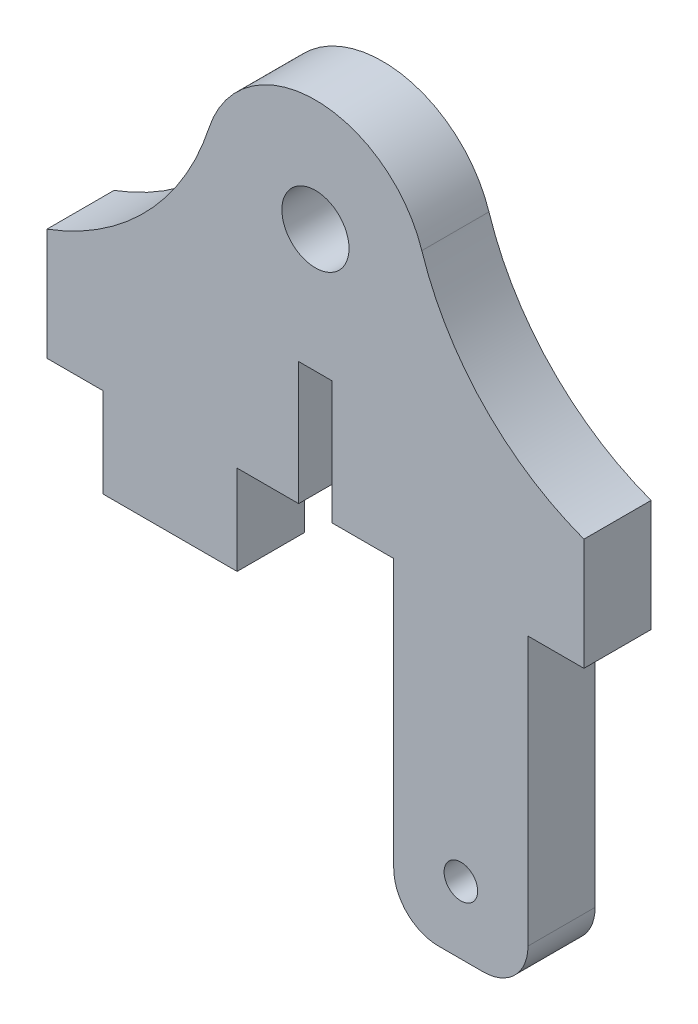
ISO-10303-21;
HEADER;
FILE_DESCRIPTION(('STEP AP214'),'2;1');
FILE_NAME('part.step','',(''),(''),'','','');
FILE_SCHEMA(('AUTOMOTIVE_DESIGN { 1 0 10303 214 1 1 1 1 }'));
ENDSEC;
DATA;
#1=APPLICATION_CONTEXT('core data for automotive mechanical design processes');
#2=APPLICATION_PROTOCOL_DEFINITION('international standard','automotive_design',2000,#1);
#3=PRODUCT_CONTEXT('',#1,'mechanical');
#4=PRODUCT('Part','Part','',(#3));
#5=PRODUCT_RELATED_PRODUCT_CATEGORY('part','',(#4));
#6=PRODUCT_DEFINITION_FORMATION('','',#4);
#7=PRODUCT_DEFINITION_CONTEXT('part definition',#1,'design');
#8=PRODUCT_DEFINITION('design','',#6,#7);
#9=PRODUCT_DEFINITION_SHAPE('','',#8);
#10=(LENGTH_UNIT() NAMED_UNIT(*) SI_UNIT(.MILLI.,.METRE.));
#11=(NAMED_UNIT(*) PLANE_ANGLE_UNIT() SI_UNIT($,.RADIAN.));
#12=(NAMED_UNIT(*) SI_UNIT($,.STERADIAN.) SOLID_ANGLE_UNIT());
#13=UNCERTAINTY_MEASURE_WITH_UNIT(LENGTH_MEASURE(1.E-05),#10,'distance_accuracy_value','');
#14=(GEOMETRIC_REPRESENTATION_CONTEXT(3) GLOBAL_UNCERTAINTY_ASSIGNED_CONTEXT((#13)) GLOBAL_UNIT_ASSIGNED_CONTEXT((#10,
#11,#12)) REPRESENTATION_CONTEXT('',''));
#15=CARTESIAN_POINT('',(0.,0.,0.));
#16=DIRECTION('',(0.,0.,1.));
#17=DIRECTION('',(1.,0.,0.));
#18=AXIS2_PLACEMENT_3D('',#15,#16,#17);
#19=CARTESIAN_POINT('',(16.1680987660606,5.25286419878796,3.));
#20=DIRECTION('',(0.,0.,-1.));
#21=DIRECTION('',(-1.,0.,0.));
#22=AXIS2_PLACEMENT_3D('',#19,#20,#21);
#23=PLANE('',#22);
#24=DIRECTION('',(0.,-1.,0.));
#25=VECTOR('',#24,1.);
#26=CARTESIAN_POINT('',(3.5,-11.,3.));
#27=LINE('',#26,#25);
#28=CARTESIAN_POINT('',(3.5,-11.,3.));
#29=VERTEX_POINT('',#28);
#30=CARTESIAN_POINT('',(3.5,-23.,3.));
#31=VERTEX_POINT('',#30);
#32=EDGE_CURVE('E215',#29,#31,#27,.T.);
#33=ORIENTED_EDGE('',*,*,#32,.T.);
#34=CARTESIAN_POINT('',(5.5,-23.,3.));
#35=DIRECTION('',(0.,0.,-1.));
#36=DIRECTION('',(-1.,0.,0.));
#37=AXIS2_PLACEMENT_3D('',#34,#35,#36);
#38=CIRCLE('',#37,2.);
#39=CARTESIAN_POINT('',(5.5,-25.,3.));
#40=VERTEX_POINT('',#39);
#41=EDGE_CURVE('E52',#31,#40,#38,.F.);
#42=ORIENTED_EDGE('',*,*,#41,.T.);
#43=DIRECTION('',(1.,0.,0.));
#44=VECTOR('',#43,1.);
#45=CARTESIAN_POINT('',(3.5,-25.,3.));
#46=LINE('',#45,#44);
#47=CARTESIAN_POINT('',(7.5,-25.,3.));
#48=VERTEX_POINT('',#47);
#49=EDGE_CURVE('E209',#40,#48,#46,.T.);
#50=ORIENTED_EDGE('',*,*,#49,.T.);
#51=CARTESIAN_POINT('',(7.5,-23.,3.));
#52=DIRECTION('',(0.,0.,-1.));
#53=DIRECTION('',(-1.,0.,0.));
#54=AXIS2_PLACEMENT_3D('',#51,#52,#53);
#55=CIRCLE('',#54,2.);
#56=CARTESIAN_POINT('',(9.5,-23.,3.));
#57=VERTEX_POINT('',#56);
#58=EDGE_CURVE('E59',#48,#57,#55,.F.);
#59=ORIENTED_EDGE('',*,*,#58,.T.);
#60=DIRECTION('',(0.,-1.,0.));
#61=VECTOR('',#60,1.);
#62=CARTESIAN_POINT('',(9.5,-25.,3.));
#63=LINE('',#62,#61);
#64=CARTESIAN_POINT('',(9.5,-11.,3.));
#65=VERTEX_POINT('',#64);
#66=EDGE_CURVE('E200',#65,#57,#63,.T.);
#67=ORIENTED_EDGE('',*,*,#66,.F.);
#68=DIRECTION('',(-1.,0.,0.));
#69=VECTOR('',#68,1.);
#70=CARTESIAN_POINT('',(12.,-11.,3.));
#71=LINE('',#70,#69);
#72=CARTESIAN_POINT('',(12.,-11.,3.));
#73=VERTEX_POINT('',#72);
#74=EDGE_CURVE('E187',#73,#65,#71,.T.);
#75=ORIENTED_EDGE('',*,*,#74,.F.);
#76=DIRECTION('',(0.,1.,0.));
#77=VECTOR('',#76,1.);
#78=CARTESIAN_POINT('',(12.,-25.,3.));
#79=LINE('',#78,#77);
#80=CARTESIAN_POINT('',(12.,-6.,3.));
#81=VERTEX_POINT('',#80);
#82=EDGE_CURVE('E198',#73,#81,#79,.T.);
#83=ORIENTED_EDGE('',*,*,#82,.T.);
#84=CARTESIAN_POINT('',(16.1680987660606,5.25286419878796,3.));
#85=DIRECTION('',(0.,0.,-1.));
#86=DIRECTION('',(-1.,0.,0.));
#87=AXIS2_PLACEMENT_3D('',#84,#85,#86);
#88=CIRCLE('',#87,12.);
#89=CARTESIAN_POINT('',(4.75532316648843,1.54496005846705,3.));
#90=VERTEX_POINT('',#89);
#91=EDGE_CURVE('E208',#81,#90,#88,.T.);
#92=ORIENTED_EDGE('',*,*,#91,.T.);
#93=CARTESIAN_POINT('',(0.,0.,3.));
#94=DIRECTION('',(0.,0.,1.));
#95=DIRECTION('',(1.,0.,0.));
#96=AXIS2_PLACEMENT_3D('',#93,#94,#95);
#97=CIRCLE('',#96,5.);
#98=CARTESIAN_POINT('',(-4.75532316648842,1.54496005846705,3.));
#99=VERTEX_POINT('',#98);
#100=EDGE_CURVE('E213',#90,#99,#97,.T.);
#101=ORIENTED_EDGE('',*,*,#100,.T.);
#102=CARTESIAN_POINT('',(-16.1680987660606,5.25286419878795,3.));
#103=DIRECTION('',(0.,0.,-1.));
#104=DIRECTION('',(1.,0.,0.));
#105=AXIS2_PLACEMENT_3D('',#102,#103,#104);
#106=CIRCLE('',#105,12.);
#107=CARTESIAN_POINT('',(-12.,-6.,3.));
#108=VERTEX_POINT('',#107);
#109=EDGE_CURVE('E221',#99,#108,#106,.T.);
#110=ORIENTED_EDGE('',*,*,#109,.T.);
#111=DIRECTION('',(0.,-1.,0.));
#112=VECTOR('',#111,1.);
#113=CARTESIAN_POINT('',(-12.,-11.,3.));
#114=LINE('',#113,#112);
#115=CARTESIAN_POINT('',(-12.,-11.,3.));
#116=VERTEX_POINT('',#115);
#117=EDGE_CURVE('E268',#108,#116,#114,.T.);
#118=ORIENTED_EDGE('',*,*,#117,.T.);
#119=DIRECTION('',(-1.,0.,0.));
#120=VECTOR('',#119,1.);
#121=CARTESIAN_POINT('',(-12.,-11.,3.));
#122=LINE('',#121,#120);
#123=CARTESIAN_POINT('',(-9.5,-11.,3.));
#124=VERTEX_POINT('',#123);
#125=EDGE_CURVE('E381',#124,#116,#122,.T.);
#126=ORIENTED_EDGE('',*,*,#125,.F.);
#127=DIRECTION('',(0.,1.,0.));
#128=VECTOR('',#127,1.);
#129=CARTESIAN_POINT('',(-9.5,-15.,3.));
#130=LINE('',#129,#128);
#131=CARTESIAN_POINT('',(-9.5,-15.,3.));
#132=VERTEX_POINT('',#131);
#133=EDGE_CURVE('E376',#132,#124,#130,.T.);
#134=ORIENTED_EDGE('',*,*,#133,.F.);
#135=DIRECTION('',(1.,0.,0.));
#136=VECTOR('',#135,1.);
#137=CARTESIAN_POINT('',(-12.,-15.,3.));
#138=LINE('',#137,#136);
#139=CARTESIAN_POINT('',(-3.5,-15.,3.));
#140=VERTEX_POINT('',#139);
#141=EDGE_CURVE('E423',#132,#140,#138,.T.);
#142=ORIENTED_EDGE('',*,*,#141,.T.);
#143=DIRECTION('',(0.,1.,0.));
#144=VECTOR('',#143,1.);
#145=CARTESIAN_POINT('',(-3.5,-15.,3.));
#146=LINE('',#145,#144);
#147=CARTESIAN_POINT('',(-3.5,-11.,3.));
#148=VERTEX_POINT('',#147);
#149=EDGE_CURVE('E389',#140,#148,#146,.T.);
#150=ORIENTED_EDGE('',*,*,#149,.T.);
#151=DIRECTION('',(1.,0.,0.));
#152=VECTOR('',#151,1.);
#153=CARTESIAN_POINT('',(-0.749999999999999,-11.,3.));
#154=LINE('',#153,#152);
#155=CARTESIAN_POINT('',(-0.749999999999999,-11.,3.));
#156=VERTEX_POINT('',#155);
#157=EDGE_CURVE('E371',#148,#156,#154,.T.);
#158=ORIENTED_EDGE('',*,*,#157,.T.);
#159=DIRECTION('',(0.,1.,0.));
#160=VECTOR('',#159,1.);
#161=CARTESIAN_POINT('',(-0.749999999999999,-11.,3.));
#162=LINE('',#161,#160);
#163=CARTESIAN_POINT('',(-0.749999999999999,-5.5,3.));
#164=VERTEX_POINT('',#163);
#165=EDGE_CURVE('E359',#156,#164,#162,.T.);
#166=ORIENTED_EDGE('',*,*,#165,.T.);
#167=DIRECTION('',(1.,0.,0.));
#168=VECTOR('',#167,1.);
#169=CARTESIAN_POINT('',(-0.749999999999999,-5.5,3.));
#170=LINE('',#169,#168);
#171=CARTESIAN_POINT('',(0.750000000000001,-5.5,3.));
#172=VERTEX_POINT('',#171);
#173=EDGE_CURVE('E354',#164,#172,#170,.T.);
#174=ORIENTED_EDGE('',*,*,#173,.T.);
#175=DIRECTION('',(0.,-1.,0.));
#176=VECTOR('',#175,1.);
#177=CARTESIAN_POINT('',(0.750000000000001,-5.5,3.));
#178=LINE('',#177,#176);
#179=CARTESIAN_POINT('',(0.750000000000002,-11.,3.));
#180=VERTEX_POINT('',#179);
#181=EDGE_CURVE('E350',#172,#180,#178,.T.);
#182=ORIENTED_EDGE('',*,*,#181,.T.);
#183=DIRECTION('',(1.,0.,0.));
#184=VECTOR('',#183,1.);
#185=CARTESIAN_POINT('',(0.750000000000002,-11.,3.));
#186=LINE('',#185,#184);
#187=EDGE_CURVE('E341',#180,#29,#186,.T.);
#188=ORIENTED_EDGE('',*,*,#187,.T.);
#189=EDGE_LOOP('',(#33,#42,#50,#59,#67,#75,#83,#92,#101,#110,#118,#126,#134,#142,#150,#158,#166,
#174,#182,#188));
#190=FACE_BOUND('',#189,.T.);
#191=CARTESIAN_POINT('',(0.,0.,3.));
#192=DIRECTION('',(0.,0.,1.));
#193=DIRECTION('',(1.,0.,0.));
#194=AXIS2_PLACEMENT_3D('',#191,#192,#193);
#195=CIRCLE('',#194,1.5);
#196=CARTESIAN_POINT('',(1.5,0.,3.));
#197=VERTEX_POINT('',#196);
#198=EDGE_CURVE('E230',#197,#197,#195,.T.);
#199=ORIENTED_EDGE('',*,*,#198,.F.);
#200=EDGE_LOOP('',(#199));
#201=FACE_BOUND('',#200,.T.);
#202=CARTESIAN_POINT('',(6.5,-22.,3.));
#203=DIRECTION('',(0.,0.,1.));
#204=DIRECTION('',(1.,0.,0.));
#205=AXIS2_PLACEMENT_3D('',#202,#203,#204);
#206=CIRCLE('',#205,0.75);
#207=CARTESIAN_POINT('',(7.25,-22.,3.));
#208=VERTEX_POINT('',#207);
#209=EDGE_CURVE('E406',#208,#208,#206,.T.);
#210=ORIENTED_EDGE('',*,*,#209,.F.);
#211=EDGE_LOOP('',(#210));
#212=FACE_BOUND('',#211,.T.);
#213=ADVANCED_FACE('F43',(#190,#201,#212),#23,.F.);
#214=CARTESIAN_POINT('',(16.1680987660606,5.25286419878796,0.));
#215=DIRECTION('',(0.,0.,-1.));
#216=DIRECTION('',(-1.,0.,0.));
#217=AXIS2_PLACEMENT_3D('',#214,#215,#216);
#218=PLANE('',#217);
#219=DIRECTION('',(1.,0.,0.));
#220=VECTOR('',#219,1.);
#221=CARTESIAN_POINT('',(3.5,-25.,0.));
#222=LINE('',#221,#220);
#223=CARTESIAN_POINT('',(5.5,-25.,0.));
#224=VERTEX_POINT('',#223);
#225=CARTESIAN_POINT('',(7.5,-25.,0.));
#226=VERTEX_POINT('',#225);
#227=EDGE_CURVE('E248',#224,#226,#222,.T.);
#228=ORIENTED_EDGE('',*,*,#227,.F.);
#229=CARTESIAN_POINT('',(5.5,-23.,0.));
#230=DIRECTION('',(0.,0.,-1.));
#231=DIRECTION('',(-1.,0.,0.));
#232=AXIS2_PLACEMENT_3D('',#229,#230,#231);
#233=CIRCLE('',#232,2.);
#234=CARTESIAN_POINT('',(3.5,-23.,0.));
#235=VERTEX_POINT('',#234);
#236=EDGE_CURVE('E315',#224,#235,#233,.T.);
#237=ORIENTED_EDGE('',*,*,#236,.T.);
#238=DIRECTION('',(0.,-1.,0.));
#239=VECTOR('',#238,1.);
#240=CARTESIAN_POINT('',(3.5,-11.,0.));
#241=LINE('',#240,#239);
#242=CARTESIAN_POINT('',(3.5,-11.,0.));
#243=VERTEX_POINT('',#242);
#244=EDGE_CURVE('E245',#243,#235,#241,.T.);
#245=ORIENTED_EDGE('',*,*,#244,.F.);
#246=DIRECTION('',(1.,0.,0.));
#247=VECTOR('',#246,1.);
#248=CARTESIAN_POINT('',(0.750000000000002,-11.,0.));
#249=LINE('',#248,#247);
#250=CARTESIAN_POINT('',(0.750000000000002,-11.,0.));
#251=VERTEX_POINT('',#250);
#252=EDGE_CURVE('E242',#251,#243,#249,.T.);
#253=ORIENTED_EDGE('',*,*,#252,.F.);
#254=DIRECTION('',(0.,-1.,0.));
#255=VECTOR('',#254,1.);
#256=CARTESIAN_POINT('',(0.750000000000001,-5.5,0.));
#257=LINE('',#256,#255);
#258=CARTESIAN_POINT('',(0.750000000000001,-5.5,0.));
#259=VERTEX_POINT('',#258);
#260=EDGE_CURVE('E239',#259,#251,#257,.T.);
#261=ORIENTED_EDGE('',*,*,#260,.F.);
#262=DIRECTION('',(1.,0.,0.));
#263=VECTOR('',#262,1.);
#264=CARTESIAN_POINT('',(-0.749999999999999,-5.5,0.));
#265=LINE('',#264,#263);
#266=CARTESIAN_POINT('',(-0.749999999999999,-5.5,0.));
#267=VERTEX_POINT('',#266);
#268=EDGE_CURVE('E236',#267,#259,#265,.T.);
#269=ORIENTED_EDGE('',*,*,#268,.F.);
#270=DIRECTION('',(0.,1.,0.));
#271=VECTOR('',#270,1.);
#272=CARTESIAN_POINT('',(-0.749999999999999,-11.,0.));
#273=LINE('',#272,#271);
#274=CARTESIAN_POINT('',(-0.749999999999999,-11.,0.));
#275=VERTEX_POINT('',#274);
#276=EDGE_CURVE('E233',#275,#267,#273,.T.);
#277=ORIENTED_EDGE('',*,*,#276,.F.);
#278=DIRECTION('',(1.,0.,0.));
#279=VECTOR('',#278,1.);
#280=CARTESIAN_POINT('',(-0.749999999999999,-11.,0.));
#281=LINE('',#280,#279);
#282=CARTESIAN_POINT('',(-3.5,-11.,0.));
#283=VERTEX_POINT('',#282);
#284=EDGE_CURVE('E229',#283,#275,#281,.T.);
#285=ORIENTED_EDGE('',*,*,#284,.F.);
#286=DIRECTION('',(0.,1.,0.));
#287=VECTOR('',#286,1.);
#288=CARTESIAN_POINT('',(-3.5,-15.,0.));
#289=LINE('',#288,#287);
#290=CARTESIAN_POINT('',(-3.5,-15.,0.));
#291=VERTEX_POINT('',#290);
#292=EDGE_CURVE('E364',#291,#283,#289,.T.);
#293=ORIENTED_EDGE('',*,*,#292,.F.);
#294=DIRECTION('',(1.,0.,0.));
#295=VECTOR('',#294,1.);
#296=CARTESIAN_POINT('',(-12.,-15.,0.));
#297=LINE('',#296,#295);
#298=CARTESIAN_POINT('',(-9.5,-15.,0.));
#299=VERTEX_POINT('',#298);
#300=EDGE_CURVE('E226',#299,#291,#297,.T.);
#301=ORIENTED_EDGE('',*,*,#300,.F.);
#302=DIRECTION('',(0.,-1.,0.));
#303=VECTOR('',#302,1.);
#304=CARTESIAN_POINT('',(-9.5,5.25286419878796,0.));
#305=LINE('',#304,#303);
#306=CARTESIAN_POINT('',(-9.5,-11.,0.));
#307=VERTEX_POINT('',#306);
#308=EDGE_CURVE('E402',#307,#299,#305,.T.);
#309=ORIENTED_EDGE('',*,*,#308,.F.);
#310=DIRECTION('',(1.,0.,0.));
#311=VECTOR('',#310,1.);
#312=CARTESIAN_POINT('',(16.1680987660606,-11.,0.));
#313=LINE('',#312,#311);
#314=CARTESIAN_POINT('',(-12.,-11.,0.));
#315=VERTEX_POINT('',#314);
#316=EDGE_CURVE('E397',#315,#307,#313,.T.);
#317=ORIENTED_EDGE('',*,*,#316,.F.);
#318=DIRECTION('',(0.,-1.,0.));
#319=VECTOR('',#318,1.);
#320=CARTESIAN_POINT('',(-12.,-11.,0.));
#321=LINE('',#320,#319);
#322=CARTESIAN_POINT('',(-12.,-6.,0.));
#323=VERTEX_POINT('',#322);
#324=EDGE_CURVE('E264',#323,#315,#321,.T.);
#325=ORIENTED_EDGE('',*,*,#324,.F.);
#326=CARTESIAN_POINT('',(-16.1680987660606,5.25286419878795,0.));
#327=DIRECTION('',(0.,0.,-1.));
#328=DIRECTION('',(1.,0.,0.));
#329=AXIS2_PLACEMENT_3D('',#326,#327,#328);
#330=CIRCLE('',#329,12.);
#331=CARTESIAN_POINT('',(-4.75532316648842,1.54496005846705,0.));
#332=VERTEX_POINT('',#331);
#333=EDGE_CURVE('E261',#332,#323,#330,.T.);
#334=ORIENTED_EDGE('',*,*,#333,.F.);
#335=CARTESIAN_POINT('',(0.,0.,0.));
#336=DIRECTION('',(0.,0.,1.));
#337=DIRECTION('',(1.,0.,0.));
#338=AXIS2_PLACEMENT_3D('',#335,#336,#337);
#339=CIRCLE('',#338,5.);
#340=CARTESIAN_POINT('',(4.75532316648843,1.54496005846705,0.));
#341=VERTEX_POINT('',#340);
#342=EDGE_CURVE('E258',#341,#332,#339,.T.);
#343=ORIENTED_EDGE('',*,*,#342,.F.);
#344=CARTESIAN_POINT('',(16.1680987660606,5.25286419878796,0.));
#345=DIRECTION('',(0.,0.,-1.));
#346=DIRECTION('',(-1.,0.,0.));
#347=AXIS2_PLACEMENT_3D('',#344,#345,#346);
#348=CIRCLE('',#347,12.);
#349=CARTESIAN_POINT('',(12.,-6.,0.));
#350=VERTEX_POINT('',#349);
#351=EDGE_CURVE('E255',#350,#341,#348,.T.);
#352=ORIENTED_EDGE('',*,*,#351,.F.);
#353=DIRECTION('',(0.,1.,0.));
#354=VECTOR('',#353,1.);
#355=CARTESIAN_POINT('',(12.,-25.,0.));
#356=LINE('',#355,#354);
#357=CARTESIAN_POINT('',(12.,-11.,0.));
#358=VERTEX_POINT('',#357);
#359=EDGE_CURVE('E252',#358,#350,#356,.T.);
#360=ORIENTED_EDGE('',*,*,#359,.F.);
#361=DIRECTION('',(1.,0.,0.));
#362=VECTOR('',#361,1.);
#363=CARTESIAN_POINT('',(16.1680987660606,-11.,0.));
#364=LINE('',#363,#362);
#365=CARTESIAN_POINT('',(9.5,-11.,0.));
#366=VERTEX_POINT('',#365);
#367=EDGE_CURVE('E189',#366,#358,#364,.T.);
#368=ORIENTED_EDGE('',*,*,#367,.F.);
#369=DIRECTION('',(0.,1.,0.));
#370=VECTOR('',#369,1.);
#371=CARTESIAN_POINT('',(9.5,5.25286419878796,0.));
#372=LINE('',#371,#370);
#373=CARTESIAN_POINT('',(9.5,-23.,0.));
#374=VERTEX_POINT('',#373);
#375=EDGE_CURVE('E439',#374,#366,#372,.T.);
#376=ORIENTED_EDGE('',*,*,#375,.F.);
#377=CARTESIAN_POINT('',(7.5,-23.,0.));
#378=DIRECTION('',(0.,0.,-1.));
#379=DIRECTION('',(-1.,0.,0.));
#380=AXIS2_PLACEMENT_3D('',#377,#378,#379);
#381=CIRCLE('',#380,2.);
#382=EDGE_CURVE('E312',#374,#226,#381,.T.);
#383=ORIENTED_EDGE('',*,*,#382,.T.);
#384=EDGE_LOOP('',(#228,#237,#245,#253,#261,#269,#277,#285,#293,#301,#309,#317,#325,#334,#343,
#352,#360,#368,#376,#383));
#385=FACE_BOUND('',#384,.T.);
#386=CARTESIAN_POINT('',(0.,0.,0.));
#387=DIRECTION('',(0.,0.,1.));
#388=DIRECTION('',(1.,0.,0.));
#389=AXIS2_PLACEMENT_3D('',#386,#387,#388);
#390=CIRCLE('',#389,1.5);
#391=CARTESIAN_POINT('',(1.5,0.,0.));
#392=VERTEX_POINT('',#391);
#393=EDGE_CURVE('E410',#392,#392,#390,.T.);
#394=ORIENTED_EDGE('',*,*,#393,.T.);
#395=EDGE_LOOP('',(#394));
#396=FACE_BOUND('',#395,.T.);
#397=CARTESIAN_POINT('',(6.5,-22.,0.));
#398=DIRECTION('',(0.,0.,1.));
#399=DIRECTION('',(1.,0.,0.));
#400=AXIS2_PLACEMENT_3D('',#397,#398,#399);
#401=CIRCLE('',#400,0.75);
#402=CARTESIAN_POINT('',(7.25,-22.,0.));
#403=VERTEX_POINT('',#402);
#404=EDGE_CURVE('E405',#403,#403,#401,.T.);
#405=ORIENTED_EDGE('',*,*,#404,.T.);
#406=EDGE_LOOP('',(#405));
#407=FACE_BOUND('',#406,.T.);
#408=ADVANCED_FACE('F333',(#385,#396,#407),#218,.T.);
#409=CARTESIAN_POINT('',(-12.,-15.,3.));
#410=DIRECTION('',(0.,1.,0.));
#411=DIRECTION('',(0.,0.,1.));
#412=AXIS2_PLACEMENT_3D('',#409,#410,#411);
#413=PLANE('',#412);
#414=ORIENTED_EDGE('',*,*,#141,.F.);
#415=DIRECTION('',(0.,0.,1.));
#416=VECTOR('',#415,1.);
#417=CARTESIAN_POINT('',(-9.5,-15.,-7.));
#418=LINE('',#417,#416);
#419=EDGE_CURVE('E393',#299,#132,#418,.T.);
#420=ORIENTED_EDGE('',*,*,#419,.F.);
#421=ORIENTED_EDGE('',*,*,#300,.T.);
#422=DIRECTION('',(0.,0.,1.));
#423=VECTOR('',#422,1.);
#424=CARTESIAN_POINT('',(-3.5,-15.,-5.31507290636733));
#425=LINE('',#424,#423);
#426=EDGE_CURVE('E383',#291,#140,#425,.T.);
#427=ORIENTED_EDGE('',*,*,#426,.T.);
#428=EDGE_LOOP('',(#414,#420,#421,#427));
#429=FACE_BOUND('',#428,.T.);
#430=ADVANCED_FACE('F482',(#429),#413,.F.);
#431=CARTESIAN_POINT('',(-0.749999999999999,-11.,3.));
#432=DIRECTION('',(0.,1.,0.));
#433=DIRECTION('',(0.,0.,1.));
#434=AXIS2_PLACEMENT_3D('',#431,#432,#433);
#435=PLANE('',#434);
#436=ORIENTED_EDGE('',*,*,#157,.F.);
#437=DIRECTION('',(0.,0.,1.));
#438=VECTOR('',#437,1.);
#439=CARTESIAN_POINT('',(-3.5,-11.,-5.31507290636733));
#440=LINE('',#439,#438);
#441=EDGE_CURVE('E370',#283,#148,#440,.T.);
#442=ORIENTED_EDGE('',*,*,#441,.F.);
#443=ORIENTED_EDGE('',*,*,#284,.T.);
#444=DIRECTION('',(0.,0.,-1.));
#445=VECTOR('',#444,1.);
#446=CARTESIAN_POINT('',(-0.749999999999999,-11.,3.));
#447=LINE('',#446,#445);
#448=EDGE_CURVE('E298',#156,#275,#447,.T.);
#449=ORIENTED_EDGE('',*,*,#448,.F.);
#450=EDGE_LOOP('',(#436,#442,#443,#449));
#451=FACE_BOUND('',#450,.T.);
#452=ADVANCED_FACE('F369',(#451),#435,.F.);
#453=CARTESIAN_POINT('',(-0.749999999999999,-11.,3.));
#454=DIRECTION('',(-1.,0.,0.));
#455=DIRECTION('',(0.,0.,1.));
#456=AXIS2_PLACEMENT_3D('',#453,#454,#455);
#457=PLANE('',#456);
#458=ORIENTED_EDGE('',*,*,#276,.T.);
#459=DIRECTION('',(0.,0.,-1.));
#460=VECTOR('',#459,1.);
#461=CARTESIAN_POINT('',(-0.749999999999999,-5.5,3.));
#462=LINE('',#461,#460);
#463=EDGE_CURVE('E294',#164,#267,#462,.T.);
#464=ORIENTED_EDGE('',*,*,#463,.F.);
#465=ORIENTED_EDGE('',*,*,#165,.F.);
#466=ORIENTED_EDGE('',*,*,#448,.T.);
#467=EDGE_LOOP('',(#458,#464,#465,#466));
#468=FACE_BOUND('',#467,.T.);
#469=ADVANCED_FACE('F358',(#468),#457,.F.);
#470=CARTESIAN_POINT('',(-0.749999999999999,-5.5,3.));
#471=DIRECTION('',(0.,1.,0.));
#472=DIRECTION('',(0.,0.,1.));
#473=AXIS2_PLACEMENT_3D('',#470,#471,#472);
#474=PLANE('',#473);
#475=ORIENTED_EDGE('',*,*,#268,.T.);
#476=DIRECTION('',(0.,0.,-1.));
#477=VECTOR('',#476,1.);
#478=CARTESIAN_POINT('',(0.750000000000001,-5.5,3.));
#479=LINE('',#478,#477);
#480=EDGE_CURVE('E290',#172,#259,#479,.T.);
#481=ORIENTED_EDGE('',*,*,#480,.F.);
#482=ORIENTED_EDGE('',*,*,#173,.F.);
#483=ORIENTED_EDGE('',*,*,#463,.T.);
#484=EDGE_LOOP('',(#475,#481,#482,#483));
#485=FACE_BOUND('',#484,.T.);
#486=ADVANCED_FACE('F353',(#485),#474,.F.);
#487=CARTESIAN_POINT('',(0.750000000000001,-5.5,3.));
#488=DIRECTION('',(1.,0.,0.));
#489=DIRECTION('',(0.,1.,0.));
#490=AXIS2_PLACEMENT_3D('',#487,#488,#489);
#491=PLANE('',#490);
#492=ORIENTED_EDGE('',*,*,#260,.T.);
#493=DIRECTION('',(0.,0.,-1.));
#494=VECTOR('',#493,1.);
#495=CARTESIAN_POINT('',(0.750000000000002,-11.,3.));
#496=LINE('',#495,#494);
#497=EDGE_CURVE('E286',#180,#251,#496,.T.);
#498=ORIENTED_EDGE('',*,*,#497,.F.);
#499=ORIENTED_EDGE('',*,*,#181,.F.);
#500=ORIENTED_EDGE('',*,*,#480,.T.);
#501=EDGE_LOOP('',(#492,#498,#499,#500));
#502=FACE_BOUND('',#501,.T.);
#503=ADVANCED_FACE('F347',(#502),#491,.F.);
#504=CARTESIAN_POINT('',(0.750000000000002,-11.,3.));
#505=DIRECTION('',(0.,1.,0.));
#506=DIRECTION('',(0.,0.,1.));
#507=AXIS2_PLACEMENT_3D('',#504,#505,#506);
#508=PLANE('',#507);
#509=ORIENTED_EDGE('',*,*,#252,.T.);
#510=DIRECTION('',(0.,0.,-1.));
#511=VECTOR('',#510,1.);
#512=CARTESIAN_POINT('',(3.5,-11.,3.));
#513=LINE('',#512,#511);
#514=EDGE_CURVE('E282',#29,#243,#513,.T.);
#515=ORIENTED_EDGE('',*,*,#514,.F.);
#516=ORIENTED_EDGE('',*,*,#187,.F.);
#517=ORIENTED_EDGE('',*,*,#497,.T.);
#518=EDGE_LOOP('',(#509,#515,#516,#517));
#519=FACE_BOUND('',#518,.T.);
#520=ADVANCED_FACE('F340',(#519),#508,.F.);
#521=CARTESIAN_POINT('',(3.5,-11.,3.));
#522=DIRECTION('',(1.,0.,0.));
#523=DIRECTION('',(0.,1.,0.));
#524=AXIS2_PLACEMENT_3D('',#521,#522,#523);
#525=PLANE('',#524);
#526=ORIENTED_EDGE('',*,*,#244,.T.);
#527=DIRECTION('',(0.,0.,-1.));
#528=VECTOR('',#527,1.);
#529=CARTESIAN_POINT('',(3.5,-23.,3.));
#530=LINE('',#529,#528);
#531=EDGE_CURVE('E67',#235,#31,#530,.F.);
#532=ORIENTED_EDGE('',*,*,#531,.T.);
#533=ORIENTED_EDGE('',*,*,#32,.F.);
#534=ORIENTED_EDGE('',*,*,#514,.T.);
#535=EDGE_LOOP('',(#526,#532,#533,#534));
#536=FACE_BOUND('',#535,.T.);
#537=ADVANCED_FACE('F336',(#536),#525,.F.);
#538=CARTESIAN_POINT('',(3.5,-25.,3.));
#539=DIRECTION('',(0.,1.,0.));
#540=DIRECTION('',(0.,0.,1.));
#541=AXIS2_PLACEMENT_3D('',#538,#539,#540);
#542=PLANE('',#541);
#543=ORIENTED_EDGE('',*,*,#49,.F.);
#544=DIRECTION('',(0.,0.,-1.));
#545=VECTOR('',#544,1.);
#546=CARTESIAN_POINT('',(5.5,-25.,3.));
#547=LINE('',#546,#545);
#548=EDGE_CURVE('E308',#40,#224,#547,.T.);
#549=ORIENTED_EDGE('',*,*,#548,.T.);
#550=ORIENTED_EDGE('',*,*,#227,.T.);
#551=DIRECTION('',(0.,0.,1.));
#552=VECTOR('',#551,1.);
#553=CARTESIAN_POINT('',(7.5,-25.,3.));
#554=LINE('',#553,#552);
#555=EDGE_CURVE('E194',#226,#48,#554,.T.);
#556=ORIENTED_EDGE('',*,*,#555,.T.);
#557=EDGE_LOOP('',(#543,#549,#550,#556));
#558=FACE_BOUND('',#557,.T.);
#559=ADVANCED_FACE('F327',(#558),#542,.F.);
#560=CARTESIAN_POINT('',(12.,-25.,3.));
#561=DIRECTION('',(-1.,0.,0.));
#562=DIRECTION('',(0.,0.,1.));
#563=AXIS2_PLACEMENT_3D('',#560,#561,#562);
#564=PLANE('',#563);
#565=ORIENTED_EDGE('',*,*,#82,.F.);
#566=DIRECTION('',(0.,0.,-1.));
#567=VECTOR('',#566,1.);
#568=CARTESIAN_POINT('',(12.,-11.,3.));
#569=LINE('',#568,#567);
#570=EDGE_CURVE('E183',#73,#358,#569,.T.);
#571=ORIENTED_EDGE('',*,*,#570,.T.);
#572=ORIENTED_EDGE('',*,*,#359,.T.);
#573=DIRECTION('',(0.,0.,-1.));
#574=VECTOR('',#573,1.);
#575=CARTESIAN_POINT('',(12.,-6.,3.));
#576=LINE('',#575,#574);
#577=EDGE_CURVE('E205',#81,#350,#576,.T.);
#578=ORIENTED_EDGE('',*,*,#577,.F.);
#579=EDGE_LOOP('',(#565,#571,#572,#578));
#580=FACE_BOUND('',#579,.T.);
#581=ADVANCED_FACE('F203',(#580),#564,.F.);
#582=CARTESIAN_POINT('',(16.1680987660606,5.25286419878796,3.));
#583=DIRECTION('',(0.,0.,-1.));
#584=DIRECTION('',(-1.,0.,0.));
#585=AXIS2_PLACEMENT_3D('',#582,#583,#584);
#586=CYLINDRICAL_SURFACE('',#585,12.);
#587=ORIENTED_EDGE('',*,*,#351,.T.);
#588=DIRECTION('',(0.,0.,-1.));
#589=VECTOR('',#588,1.);
#590=CARTESIAN_POINT('',(4.75532316648843,1.54496005846705,3.));
#591=LINE('',#590,#589);
#592=EDGE_CURVE('E276',#90,#341,#591,.T.);
#593=ORIENTED_EDGE('',*,*,#592,.F.);
#594=ORIENTED_EDGE('',*,*,#91,.F.);
#595=ORIENTED_EDGE('',*,*,#577,.T.);
#596=EDGE_LOOP('',(#587,#593,#594,#595));
#597=FACE_BOUND('',#596,.T.);
#598=ADVANCED_FACE('F458',(#597),#586,.F.);
#599=CARTESIAN_POINT('',(0.,0.,3.));
#600=DIRECTION('',(0.,0.,-1.));
#601=DIRECTION('',(-1.,0.,0.));
#602=AXIS2_PLACEMENT_3D('',#599,#600,#601);
#603=CYLINDRICAL_SURFACE('',#602,5.);
#604=ORIENTED_EDGE('',*,*,#342,.T.);
#605=DIRECTION('',(0.,0.,-1.));
#606=VECTOR('',#605,1.);
#607=CARTESIAN_POINT('',(-4.75532316648842,1.54496005846705,3.));
#608=LINE('',#607,#606);
#609=EDGE_CURVE('E272',#99,#332,#608,.T.);
#610=ORIENTED_EDGE('',*,*,#609,.F.);
#611=ORIENTED_EDGE('',*,*,#100,.F.);
#612=ORIENTED_EDGE('',*,*,#592,.T.);
#613=EDGE_LOOP('',(#604,#610,#611,#612));
#614=FACE_BOUND('',#613,.T.);
#615=ADVANCED_FACE('F465',(#614),#603,.T.);
#616=CARTESIAN_POINT('',(-16.1680987660606,5.25286419878795,3.));
#617=DIRECTION('',(0.,0.,-1.));
#618=DIRECTION('',(-1.,0.,0.));
#619=AXIS2_PLACEMENT_3D('',#616,#617,#618);
#620=CYLINDRICAL_SURFACE('',#619,12.);
#621=ORIENTED_EDGE('',*,*,#333,.T.);
#622=DIRECTION('',(0.,0.,-1.));
#623=VECTOR('',#622,1.);
#624=CARTESIAN_POINT('',(-12.,-6.,3.));
#625=LINE('',#624,#623);
#626=EDGE_CURVE('E225',#108,#323,#625,.T.);
#627=ORIENTED_EDGE('',*,*,#626,.F.);
#628=ORIENTED_EDGE('',*,*,#109,.F.);
#629=ORIENTED_EDGE('',*,*,#609,.T.);
#630=EDGE_LOOP('',(#621,#627,#628,#629));
#631=FACE_BOUND('',#630,.T.);
#632=ADVANCED_FACE('F468',(#631),#620,.F.);
#633=CARTESIAN_POINT('',(-12.,-11.,3.));
#634=DIRECTION('',(1.,0.,0.));
#635=DIRECTION('',(0.,0.,-1.));
#636=AXIS2_PLACEMENT_3D('',#633,#634,#635);
#637=PLANE('',#636);
#638=ORIENTED_EDGE('',*,*,#324,.T.);
#639=DIRECTION('',(0.,0.,1.));
#640=VECTOR('',#639,1.);
#641=CARTESIAN_POINT('',(-12.,-11.,3.));
#642=LINE('',#641,#640);
#643=EDGE_CURVE('E195',#315,#116,#642,.T.);
#644=ORIENTED_EDGE('',*,*,#643,.T.);
#645=ORIENTED_EDGE('',*,*,#117,.F.);
#646=ORIENTED_EDGE('',*,*,#626,.T.);
#647=EDGE_LOOP('',(#638,#644,#645,#646));
#648=FACE_BOUND('',#647,.T.);
#649=ADVANCED_FACE('F471',(#648),#637,.F.);
#650=CARTESIAN_POINT('',(0.,0.,3.));
#651=DIRECTION('',(0.,0.,-1.));
#652=DIRECTION('',(-1.,0.,0.));
#653=AXIS2_PLACEMENT_3D('',#650,#651,#652);
#654=CYLINDRICAL_SURFACE('',#653,1.5);
#655=ORIENTED_EDGE('',*,*,#198,.T.);
#656=EDGE_LOOP('',(#655));
#657=FACE_BOUND('',#656,.T.);
#658=ORIENTED_EDGE('',*,*,#393,.F.);
#659=EDGE_LOOP('',(#658));
#660=FACE_BOUND('',#659,.T.);
#661=ADVANCED_FACE('F501',(#657,#660),#654,.F.);
#662=CARTESIAN_POINT('',(6.5,-22.,3.));
#663=DIRECTION('',(0.,0.,-1.));
#664=DIRECTION('',(-1.,0.,0.));
#665=AXIS2_PLACEMENT_3D('',#662,#663,#664);
#666=CYLINDRICAL_SURFACE('',#665,0.75);
#667=ORIENTED_EDGE('',*,*,#209,.T.);
#668=EDGE_LOOP('',(#667));
#669=FACE_BOUND('',#668,.T.);
#670=ORIENTED_EDGE('',*,*,#404,.F.);
#671=EDGE_LOOP('',(#670));
#672=FACE_BOUND('',#671,.T.);
#673=ADVANCED_FACE('F600',(#669,#672),#666,.F.);
#674=CARTESIAN_POINT('',(-12.,-11.,-7.));
#675=DIRECTION('',(0.,1.,0.));
#676=DIRECTION('',(0.,0.,1.));
#677=AXIS2_PLACEMENT_3D('',#674,#675,#676);
#678=PLANE('',#677);
#679=ORIENTED_EDGE('',*,*,#316,.T.);
#680=DIRECTION('',(0.,0.,1.));
#681=VECTOR('',#680,1.);
#682=CARTESIAN_POINT('',(-9.5,-11.,-7.));
#683=LINE('',#682,#681);
#684=EDGE_CURVE('E394',#307,#124,#683,.T.);
#685=ORIENTED_EDGE('',*,*,#684,.T.);
#686=ORIENTED_EDGE('',*,*,#125,.T.);
#687=ORIENTED_EDGE('',*,*,#643,.F.);
#688=EDGE_LOOP('',(#679,#685,#686,#687));
#689=FACE_BOUND('',#688,.T.);
#690=ADVANCED_FACE('F476',(#689),#678,.F.);
#691=CARTESIAN_POINT('',(-9.5,-15.,-7.));
#692=DIRECTION('',(1.,0.,0.));
#693=DIRECTION('',(0.,0.,-1.));
#694=AXIS2_PLACEMENT_3D('',#691,#692,#693);
#695=PLANE('',#694);
#696=ORIENTED_EDGE('',*,*,#308,.T.);
#697=ORIENTED_EDGE('',*,*,#419,.T.);
#698=ORIENTED_EDGE('',*,*,#133,.T.);
#699=ORIENTED_EDGE('',*,*,#684,.F.);
#700=EDGE_LOOP('',(#696,#697,#698,#699));
#701=FACE_BOUND('',#700,.T.);
#702=ADVANCED_FACE('F478',(#701),#695,.F.);
#703=CARTESIAN_POINT('',(-3.5,-15.,-5.31507290636733));
#704=DIRECTION('',(1.,0.,0.));
#705=DIRECTION('',(0.,0.,-1.));
#706=AXIS2_PLACEMENT_3D('',#703,#704,#705);
#707=PLANE('',#706);
#708=ORIENTED_EDGE('',*,*,#426,.F.);
#709=ORIENTED_EDGE('',*,*,#292,.T.);
#710=ORIENTED_EDGE('',*,*,#441,.T.);
#711=ORIENTED_EDGE('',*,*,#149,.F.);
#712=EDGE_LOOP('',(#708,#709,#710,#711));
#713=FACE_BOUND('',#712,.T.);
#714=ADVANCED_FACE('F483',(#713),#707,.T.);
#715=CARTESIAN_POINT('',(9.5,-25.,-7.));
#716=DIRECTION('',(-1.,0.,0.));
#717=DIRECTION('',(0.,0.,1.));
#718=AXIS2_PLACEMENT_3D('',#715,#716,#717);
#719=PLANE('',#718);
#720=ORIENTED_EDGE('',*,*,#66,.T.);
#721=DIRECTION('',(0.,0.,1.));
#722=VECTOR('',#721,1.);
#723=CARTESIAN_POINT('',(9.5,-23.,-7.));
#724=LINE('',#723,#722);
#725=EDGE_CURVE('E11',#57,#374,#724,.F.);
#726=ORIENTED_EDGE('',*,*,#725,.T.);
#727=ORIENTED_EDGE('',*,*,#375,.T.);
#728=DIRECTION('',(0.,0.,1.));
#729=VECTOR('',#728,1.);
#730=CARTESIAN_POINT('',(9.5,-11.,-7.));
#731=LINE('',#730,#729);
#732=EDGE_CURVE('E445',#366,#65,#731,.T.);
#733=ORIENTED_EDGE('',*,*,#732,.T.);
#734=EDGE_LOOP('',(#720,#726,#727,#733));
#735=FACE_BOUND('',#734,.T.);
#736=ADVANCED_FACE('F451',(#735),#719,.F.);
#737=CARTESIAN_POINT('',(12.,-11.,-7.));
#738=DIRECTION('',(0.,1.,0.));
#739=DIRECTION('',(0.,0.,1.));
#740=AXIS2_PLACEMENT_3D('',#737,#738,#739);
#741=PLANE('',#740);
#742=ORIENTED_EDGE('',*,*,#367,.T.);
#743=ORIENTED_EDGE('',*,*,#570,.F.);
#744=ORIENTED_EDGE('',*,*,#74,.T.);
#745=ORIENTED_EDGE('',*,*,#732,.F.);
#746=EDGE_LOOP('',(#742,#743,#744,#745));
#747=FACE_BOUND('',#746,.T.);
#748=ADVANCED_FACE('F185',(#747),#741,.F.);
#749=CARTESIAN_POINT('',(5.5,-23.,3.));
#750=DIRECTION('',(0.,0.,-1.));
#751=DIRECTION('',(-1.,0.,0.));
#752=AXIS2_PLACEMENT_3D('',#749,#750,#751);
#753=CYLINDRICAL_SURFACE('',#752,2.);
#754=ORIENTED_EDGE('',*,*,#41,.F.);
#755=ORIENTED_EDGE('',*,*,#531,.F.);
#756=ORIENTED_EDGE('',*,*,#236,.F.);
#757=ORIENTED_EDGE('',*,*,#548,.F.);
#758=EDGE_LOOP('',(#754,#755,#756,#757));
#759=FACE_BOUND('',#758,.T.);
#760=ADVANCED_FACE('F330',(#759),#753,.T.);
#761=CARTESIAN_POINT('',(7.5,-23.,3.));
#762=DIRECTION('',(0.,0.,1.));
#763=DIRECTION('',(1.,0.,0.));
#764=AXIS2_PLACEMENT_3D('',#761,#762,#763);
#765=CYLINDRICAL_SURFACE('',#764,2.);
#766=ORIENTED_EDGE('',*,*,#382,.F.);
#767=ORIENTED_EDGE('',*,*,#725,.F.);
#768=ORIENTED_EDGE('',*,*,#58,.F.);
#769=ORIENTED_EDGE('',*,*,#555,.F.);
#770=EDGE_LOOP('',(#766,#767,#768,#769));
#771=FACE_BOUND('',#770,.T.);
#772=ADVANCED_FACE('F45',(#771),#765,.T.);
#773=CLOSED_SHELL('',(#213,#408,#430,#452,#469,#486,#503,#520,#537,#559,#581,#598,#615,#632,
#649,#661,#673,#690,#702,#714,#736,#748,#760,#772));
#774=MANIFOLD_SOLID_BREP('B2',#773);
#775=ADVANCED_BREP_SHAPE_REPRESENTATION('',(#18,#774),#14);
#776=SHAPE_DEFINITION_REPRESENTATION(#9,#775);
ENDSEC;
END-ISO-10303-21;
